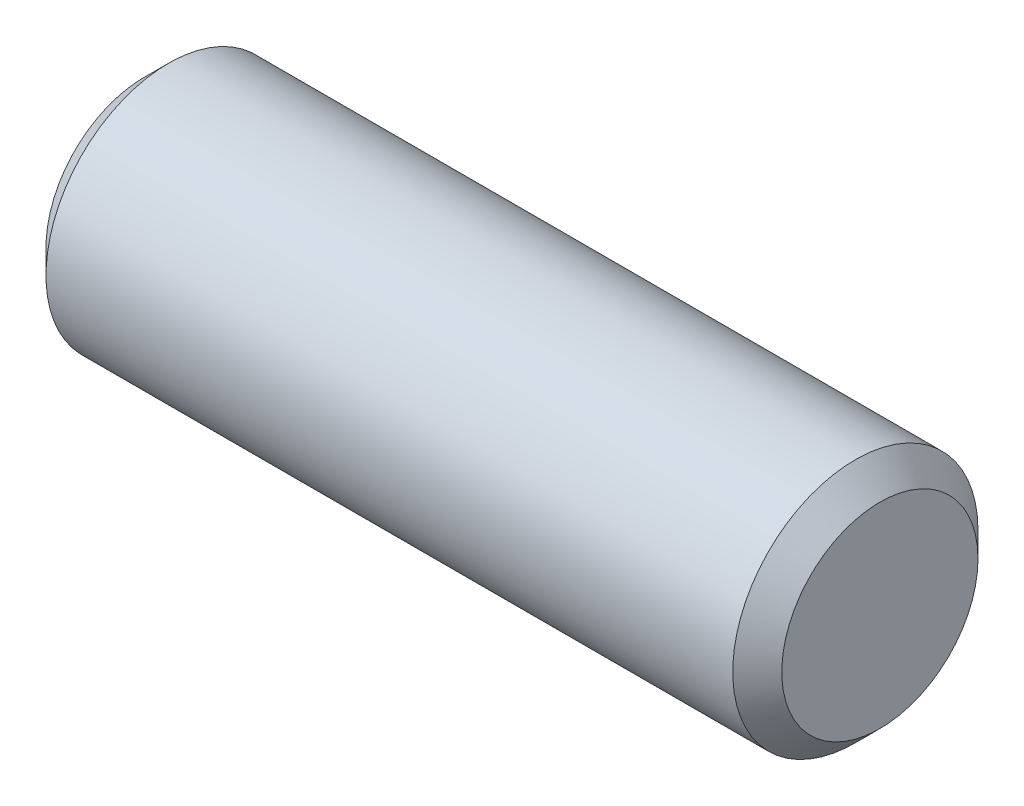
ISO-10303-21;
HEADER;
FILE_DESCRIPTION(('STEP AP214'),'2;1');
FILE_NAME('part.step','',(''),(''),'','','');
FILE_SCHEMA(('AUTOMOTIVE_DESIGN { 1 0 10303 214 1 1 1 1 }'));
ENDSEC;
DATA;
#1=APPLICATION_CONTEXT('core data for automotive mechanical design processes');
#2=APPLICATION_PROTOCOL_DEFINITION('international standard','automotive_design',2000,#1);
#3=PRODUCT_CONTEXT('',#1,'mechanical');
#4=PRODUCT('Part','Part','',(#3));
#5=PRODUCT_RELATED_PRODUCT_CATEGORY('part','',(#4));
#6=PRODUCT_DEFINITION_FORMATION('','',#4);
#7=PRODUCT_DEFINITION_CONTEXT('part definition',#1,'design');
#8=PRODUCT_DEFINITION('design','',#6,#7);
#9=PRODUCT_DEFINITION_SHAPE('','',#8);
#10=(LENGTH_UNIT() NAMED_UNIT(*) SI_UNIT(.MILLI.,.METRE.));
#11=(NAMED_UNIT(*) PLANE_ANGLE_UNIT() SI_UNIT($,.RADIAN.));
#12=(NAMED_UNIT(*) SI_UNIT($,.STERADIAN.) SOLID_ANGLE_UNIT());
#13=UNCERTAINTY_MEASURE_WITH_UNIT(LENGTH_MEASURE(1.E-05),#10,'distance_accuracy_value','');
#14=(GEOMETRIC_REPRESENTATION_CONTEXT(3) GLOBAL_UNCERTAINTY_ASSIGNED_CONTEXT((#13)) GLOBAL_UNIT_ASSIGNED_CONTEXT((#10,
#11,#12)) REPRESENTATION_CONTEXT('',''));
#15=CARTESIAN_POINT('',(0.,0.,0.));
#16=DIRECTION('',(0.,0.,1.));
#17=DIRECTION('',(1.,0.,0.));
#18=AXIS2_PLACEMENT_3D('',#15,#16,#17);
#19=CARTESIAN_POINT('',(-4.7625,0.,0.));
#20=DIRECTION('',(1.,0.,0.));
#21=DIRECTION('',(0.,0.,-1.));
#22=AXIS2_PLACEMENT_3D('',#19,#20,#21);
#23=CYLINDRICAL_SURFACE('',#22,1.5875);
#24=CARTESIAN_POINT('',(4.445,0.,0.));
#25=DIRECTION('',(1.,0.,0.));
#26=DIRECTION('',(0.,0.,-1.));
#27=AXIS2_PLACEMENT_3D('',#24,#25,#26);
#28=CIRCLE('',#27,1.5875);
#29=CARTESIAN_POINT('',(4.445,0.,-1.5875));
#30=VERTEX_POINT('',#29);
#31=EDGE_CURVE('E36',#30,#30,#28,.F.);
#32=ORIENTED_EDGE('',*,*,#31,.T.);
#33=EDGE_LOOP('',(#32));
#34=FACE_BOUND('',#33,.T.);
#35=CARTESIAN_POINT('',(-4.445,0.,0.));
#36=DIRECTION('',(1.,0.,0.));
#37=DIRECTION('',(0.,0.,-1.));
#38=AXIS2_PLACEMENT_3D('',#35,#36,#37);
#39=CIRCLE('',#38,1.5875);
#40=CARTESIAN_POINT('',(-4.445,0.,-1.5875));
#41=VERTEX_POINT('',#40);
#42=EDGE_CURVE('E40',#41,#41,#39,.T.);
#43=ORIENTED_EDGE('',*,*,#42,.T.);
#44=EDGE_LOOP('',(#43));
#45=FACE_BOUND('',#44,.T.);
#46=ADVANCED_FACE('F29',(#34,#45),#23,.T.);
#47=CARTESIAN_POINT('',(-4.7625,0.,0.));
#48=DIRECTION('',(1.,0.,0.));
#49=DIRECTION('',(0.,0.,-1.));
#50=AXIS2_PLACEMENT_3D('',#47,#48,#49);
#51=PLANE('',#50);
#52=CARTESIAN_POINT('',(-4.7625,0.,0.));
#53=DIRECTION('',(1.,0.,0.));
#54=DIRECTION('',(0.,0.,-1.));
#55=AXIS2_PLACEMENT_3D('',#52,#53,#54);
#56=CIRCLE('',#55,1.27);
#57=CARTESIAN_POINT('',(-4.7625,0.,-1.27));
#58=VERTEX_POINT('',#57);
#59=EDGE_CURVE('E10',#58,#58,#56,.F.);
#60=ORIENTED_EDGE('',*,*,#59,.T.);
#61=EDGE_LOOP('',(#60));
#62=FACE_BOUND('',#61,.T.);
#63=ADVANCED_FACE('F60',(#62),#51,.F.);
#64=CARTESIAN_POINT('',(4.7625,0.,0.));
#65=DIRECTION('',(1.,0.,0.));
#66=DIRECTION('',(0.,0.,-1.));
#67=AXIS2_PLACEMENT_3D('',#64,#65,#66);
#68=PLANE('',#67);
#69=CARTESIAN_POINT('',(4.7625,0.,0.));
#70=DIRECTION('',(1.,0.,0.));
#71=DIRECTION('',(0.,0.,-1.));
#72=AXIS2_PLACEMENT_3D('',#69,#70,#71);
#73=CIRCLE('',#72,1.27);
#74=CARTESIAN_POINT('',(4.7625,0.,-1.27));
#75=VERTEX_POINT('',#74);
#76=EDGE_CURVE('E44',#75,#75,#73,.T.);
#77=ORIENTED_EDGE('',*,*,#76,.T.);
#78=EDGE_LOOP('',(#77));
#79=FACE_BOUND('',#78,.T.);
#80=ADVANCED_FACE('F50',(#79),#68,.T.);
#81=CARTESIAN_POINT('',(4.7625,0.,0.));
#82=DIRECTION('',(-1.,0.,0.));
#83=DIRECTION('',(0.,0.,1.));
#84=AXIS2_PLACEMENT_3D('',#81,#82,#83);
#85=CONICAL_SURFACE('',#84,1.27,0.785398163397446);
#86=ORIENTED_EDGE('',*,*,#31,.F.);
#87=EDGE_LOOP('',(#86));
#88=FACE_BOUND('',#87,.T.);
#89=ORIENTED_EDGE('',*,*,#76,.F.);
#90=EDGE_LOOP('',(#89));
#91=FACE_BOUND('',#90,.T.);
#92=ADVANCED_FACE('F52',(#88,#91),#85,.T.);
#93=CARTESIAN_POINT('',(-4.445,0.,0.));
#94=DIRECTION('',(1.,0.,0.));
#95=DIRECTION('',(0.,0.,-1.));
#96=AXIS2_PLACEMENT_3D('',#93,#94,#95);
#97=CONICAL_SURFACE('',#96,1.5875,0.78539816339745);
#98=ORIENTED_EDGE('',*,*,#59,.F.);
#99=EDGE_LOOP('',(#98));
#100=FACE_BOUND('',#99,.T.);
#101=ORIENTED_EDGE('',*,*,#42,.F.);
#102=EDGE_LOOP('',(#101));
#103=FACE_BOUND('',#102,.T.);
#104=ADVANCED_FACE('F31',(#100,#103),#97,.T.);
#105=CLOSED_SHELL('',(#46,#63,#80,#92,#104));
#106=MANIFOLD_SOLID_BREP('B2',#105);
#107=ADVANCED_BREP_SHAPE_REPRESENTATION('',(#18,#106),#14);
#108=SHAPE_DEFINITION_REPRESENTATION(#9,#107);
ENDSEC;
END-ISO-10303-21;
